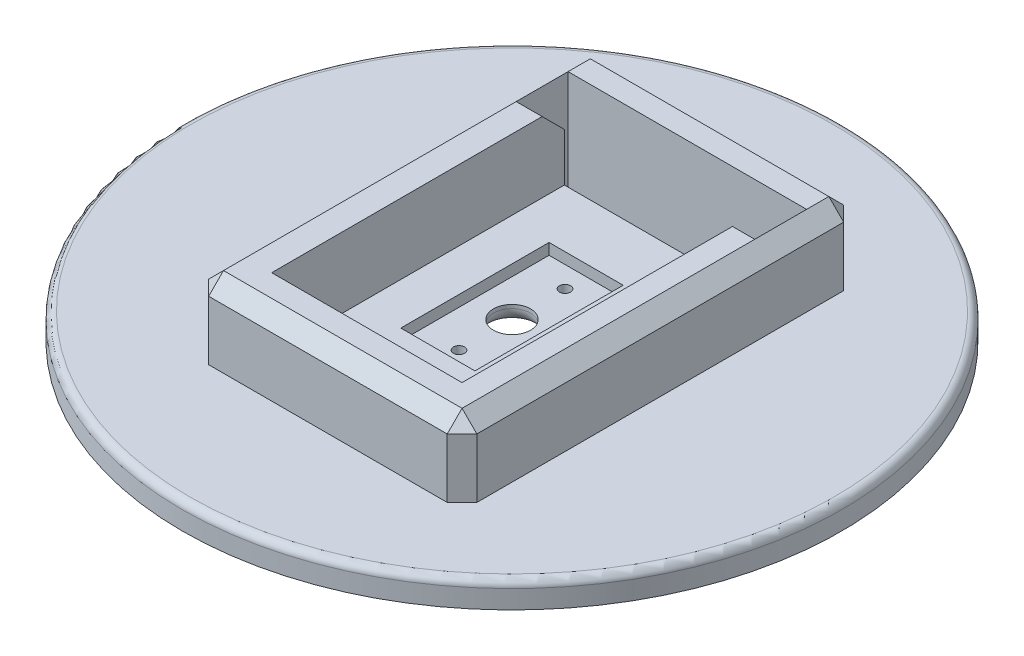
ISO-10303-21;
HEADER;
FILE_DESCRIPTION(('STEP AP214'),'2;1');
FILE_NAME('part.step','',(''),(''),'','','');
FILE_SCHEMA(('AUTOMOTIVE_DESIGN { 1 0 10303 214 1 1 1 1 }'));
ENDSEC;
DATA;
#1=APPLICATION_CONTEXT('core data for automotive mechanical design processes');
#2=APPLICATION_PROTOCOL_DEFINITION('international standard','automotive_design',2000,#1);
#3=PRODUCT_CONTEXT('',#1,'mechanical');
#4=PRODUCT('Part','Part','',(#3));
#5=PRODUCT_RELATED_PRODUCT_CATEGORY('part','',(#4));
#6=PRODUCT_DEFINITION_FORMATION('','',#4);
#7=PRODUCT_DEFINITION_CONTEXT('part definition',#1,'design');
#8=PRODUCT_DEFINITION('design','',#6,#7);
#9=PRODUCT_DEFINITION_SHAPE('','',#8);
#10=(LENGTH_UNIT() NAMED_UNIT(*) SI_UNIT(.MILLI.,.METRE.));
#11=(NAMED_UNIT(*) PLANE_ANGLE_UNIT() SI_UNIT($,.RADIAN.));
#12=(NAMED_UNIT(*) SI_UNIT($,.STERADIAN.) SOLID_ANGLE_UNIT());
#13=UNCERTAINTY_MEASURE_WITH_UNIT(LENGTH_MEASURE(1.E-05),#10,'distance_accuracy_value','');
#14=(GEOMETRIC_REPRESENTATION_CONTEXT(3) GLOBAL_UNCERTAINTY_ASSIGNED_CONTEXT((#13)) GLOBAL_UNIT_ASSIGNED_CONTEXT((#10,
#11,#12)) REPRESENTATION_CONTEXT('',''));
#15=CARTESIAN_POINT('',(0.,0.,0.));
#16=DIRECTION('',(0.,0.,1.));
#17=DIRECTION('',(1.,0.,0.));
#18=AXIS2_PLACEMENT_3D('',#15,#16,#17);
#19=CARTESIAN_POINT('',(0.,2.5,0.));
#20=DIRECTION('',(0.,1.,0.));
#21=DIRECTION('',(0.,0.,1.));
#22=AXIS2_PLACEMENT_3D('',#19,#20,#21);
#23=PLANE('',#22);
#24=CARTESIAN_POINT('',(0.,2.5,-7.15));
#25=DIRECTION('',(0.,1.,0.));
#26=DIRECTION('',(0.,0.,1.));
#27=AXIS2_PLACEMENT_3D('',#24,#25,#26);
#28=CIRCLE('',#27,0.75);
#29=CARTESIAN_POINT('',(0.,2.5,-6.4));
#30=VERTEX_POINT('',#29);
#31=EDGE_CURVE('E272',#30,#30,#28,.T.);
#32=ORIENTED_EDGE('',*,*,#31,.F.);
#33=EDGE_LOOP('',(#32));
#34=FACE_BOUND('',#33,.T.);
#35=CARTESIAN_POINT('',(0.,2.5,7.15));
#36=DIRECTION('',(0.,1.,0.));
#37=DIRECTION('',(0.,0.,1.));
#38=AXIS2_PLACEMENT_3D('',#35,#36,#37);
#39=CIRCLE('',#38,0.749999999999999);
#40=CARTESIAN_POINT('',(0.,2.5,7.9));
#41=VERTEX_POINT('',#40);
#42=EDGE_CURVE('E267',#41,#41,#39,.T.);
#43=ORIENTED_EDGE('',*,*,#42,.F.);
#44=EDGE_LOOP('',(#43));
#45=FACE_BOUND('',#44,.T.);
#46=CARTESIAN_POINT('',(0.,2.5,0.));
#47=DIRECTION('',(0.,1.,0.));
#48=DIRECTION('',(0.,0.,1.));
#49=AXIS2_PLACEMENT_3D('',#46,#47,#48);
#50=CIRCLE('',#49,2.5);
#51=CARTESIAN_POINT('',(0.,2.5,2.5));
#52=VERTEX_POINT('',#51);
#53=EDGE_CURVE('E276',#52,#52,#50,.T.);
#54=ORIENTED_EDGE('',*,*,#53,.F.);
#55=EDGE_LOOP('',(#54));
#56=FACE_BOUND('',#55,.T.);
#57=DIRECTION('',(0.,0.,1.));
#58=VECTOR('',#57,1.);
#59=CARTESIAN_POINT('',(5.,2.5,0.));
#60=LINE('',#59,#58);
#61=CARTESIAN_POINT('',(5.,2.5,-10.));
#62=VERTEX_POINT('',#61);
#63=CARTESIAN_POINT('',(5.,2.5,10.));
#64=VERTEX_POINT('',#63);
#65=EDGE_CURVE('E539',#62,#64,#60,.T.);
#66=ORIENTED_EDGE('',*,*,#65,.F.);
#67=DIRECTION('',(1.,0.,0.));
#68=VECTOR('',#67,1.);
#69=CARTESIAN_POINT('',(0.,2.5,-10.));
#70=LINE('',#69,#68);
#71=CARTESIAN_POINT('',(-5.,2.5,-10.));
#72=VERTEX_POINT('',#71);
#73=EDGE_CURVE('E535',#72,#62,#70,.T.);
#74=ORIENTED_EDGE('',*,*,#73,.F.);
#75=DIRECTION('',(0.,0.,-1.));
#76=VECTOR('',#75,1.);
#77=CARTESIAN_POINT('',(-5.,2.5,0.));
#78=LINE('',#77,#76);
#79=CARTESIAN_POINT('',(-5.,2.5,10.));
#80=VERTEX_POINT('',#79);
#81=EDGE_CURVE('E232',#80,#72,#78,.T.);
#82=ORIENTED_EDGE('',*,*,#81,.F.);
#83=DIRECTION('',(-1.,0.,0.));
#84=VECTOR('',#83,1.);
#85=CARTESIAN_POINT('',(0.,2.5,10.));
#86=LINE('',#85,#84);
#87=EDGE_CURVE('E542',#64,#80,#86,.T.);
#88=ORIENTED_EDGE('',*,*,#87,.F.);
#89=EDGE_LOOP('',(#66,#74,#82,#88));
#90=FACE_BOUND('',#89,.T.);
#91=ADVANCED_FACE('F47',(#34,#45,#56,#90),#23,.T.);
#92=CARTESIAN_POINT('',(0.,13.5,0.));
#93=DIRECTION('',(0.,1.,0.));
#94=DIRECTION('',(0.,0.,1.));
#95=AXIS2_PLACEMENT_3D('',#92,#93,#94);
#96=PLANE('',#95);
#97=DIRECTION('',(1.,0.,0.));
#98=VECTOR('',#97,1.);
#99=CARTESIAN_POINT('',(0.,13.5,-21.7375));
#100=LINE('',#99,#98);
#101=CARTESIAN_POINT('',(-14.175,13.5,-21.7375));
#102=VERTEX_POINT('',#101);
#103=CARTESIAN_POINT('',(18.,13.5,-21.7375));
#104=VERTEX_POINT('',#103);
#105=EDGE_CURVE('E298',#102,#104,#100,.T.);
#106=ORIENTED_EDGE('',*,*,#105,.T.);
#107=DIRECTION('',(0.,0.,-1.));
#108=VECTOR('',#107,1.);
#109=CARTESIAN_POINT('',(18.,13.5,0.));
#110=LINE('',#109,#108);
#111=CARTESIAN_POINT('',(18.,13.5,-24.7375));
#112=VERTEX_POINT('',#111);
#113=EDGE_CURVE('E380',#104,#112,#110,.T.);
#114=ORIENTED_EDGE('',*,*,#113,.T.);
#115=DIRECTION('',(-1.,0.,0.));
#116=VECTOR('',#115,1.);
#117=CARTESIAN_POINT('',(0.,13.5,-24.7375));
#118=LINE('',#117,#116);
#119=CARTESIAN_POINT('',(-14.175,13.5,-24.7375));
#120=VERTEX_POINT('',#119);
#121=EDGE_CURVE('E393',#112,#120,#118,.T.);
#122=ORIENTED_EDGE('',*,*,#121,.T.);
#123=DIRECTION('',(0.,0.,1.));
#124=VECTOR('',#123,1.);
#125=CARTESIAN_POINT('',(-14.175,13.5,0.));
#126=LINE('',#125,#124);
#127=EDGE_CURVE('E389',#120,#102,#126,.T.);
#128=ORIENTED_EDGE('',*,*,#127,.T.);
#129=EDGE_LOOP('',(#106,#114,#122,#128));
#130=FACE_BOUND('',#129,.T.);
#131=ADVANCED_FACE('F565',(#130),#96,.T.);
#132=CARTESIAN_POINT('',(0.,3.5,0.));
#133=DIRECTION('',(0.,-1.,0.));
#134=DIRECTION('',(0.,0.,-1.));
#135=AXIS2_PLACEMENT_3D('',#132,#133,#134);
#136=CYLINDRICAL_SURFACE('',#135,44.45);
#137=CARTESIAN_POINT('',(0.,2.5,0.));
#138=DIRECTION('',(0.,1.,0.));
#139=DIRECTION('',(0.,0.,1.));
#140=AXIS2_PLACEMENT_3D('',#137,#138,#139);
#141=CIRCLE('',#140,44.45);
#142=CARTESIAN_POINT('',(0.,2.5,44.45));
#143=VERTEX_POINT('',#142);
#144=EDGE_CURVE('E339',#143,#143,#141,.F.);
#145=ORIENTED_EDGE('',*,*,#144,.T.);
#146=EDGE_LOOP('',(#145));
#147=FACE_BOUND('',#146,.T.);
#148=CARTESIAN_POINT('',(0.,0.,0.));
#149=DIRECTION('',(0.,1.,0.));
#150=DIRECTION('',(0.,0.,1.));
#151=AXIS2_PLACEMENT_3D('',#148,#149,#150);
#152=CIRCLE('',#151,44.45);
#153=CARTESIAN_POINT('',(0.,0.,44.45));
#154=VERTEX_POINT('',#153);
#155=EDGE_CURVE('E321',#154,#154,#152,.T.);
#156=ORIENTED_EDGE('',*,*,#155,.T.);
#157=EDGE_LOOP('',(#156));
#158=FACE_BOUND('',#157,.T.);
#159=ADVANCED_FACE('F650',(#147,#158),#136,.T.);
#160=CARTESIAN_POINT('',(0.,3.5,0.));
#161=DIRECTION('',(0.,1.,0.));
#162=DIRECTION('',(0.,0.,1.));
#163=AXIS2_PLACEMENT_3D('',#160,#161,#162);
#164=PLANE('',#163);
#165=CARTESIAN_POINT('',(0.,3.5,0.));
#166=DIRECTION('',(0.,1.,0.));
#167=DIRECTION('',(0.,0.,1.));
#168=AXIS2_PLACEMENT_3D('',#165,#166,#167);
#169=CIRCLE('',#168,43.45);
#170=CARTESIAN_POINT('',(0.,3.5,43.45));
#171=VERTEX_POINT('',#170);
#172=EDGE_CURVE('E331',#171,#171,#169,.T.);
#173=ORIENTED_EDGE('',*,*,#172,.T.);
#174=EDGE_LOOP('',(#173));
#175=FACE_BOUND('',#174,.T.);
#176=DIRECTION('',(0.,0.,1.));
#177=VECTOR('',#176,1.);
#178=CARTESIAN_POINT('',(20.,3.5,0.));
#179=LINE('',#178,#177);
#180=CARTESIAN_POINT('',(20.,3.5,-24.7375));
#181=VERTEX_POINT('',#180);
#182=CARTESIAN_POINT('',(20.,3.5,24.7375));
#183=VERTEX_POINT('',#182);
#184=EDGE_CURVE('E305',#181,#183,#179,.T.);
#185=ORIENTED_EDGE('',*,*,#184,.T.);
#186=DIRECTION('',(0.707106781186548,0.,-0.707106781186548));
#187=VECTOR('',#186,1.);
#188=CARTESIAN_POINT('',(20.,3.5,24.7375));
#189=LINE('',#188,#187);
#190=CARTESIAN_POINT('',(18.,3.5,26.7375));
#191=VERTEX_POINT('',#190);
#192=EDGE_CURVE('E403',#183,#191,#189,.F.);
#193=ORIENTED_EDGE('',*,*,#192,.T.);
#194=DIRECTION('',(-1.,0.,0.));
#195=VECTOR('',#194,1.);
#196=CARTESIAN_POINT('',(0.,3.5,26.7375));
#197=LINE('',#196,#195);
#198=CARTESIAN_POINT('',(-14.175,3.5,26.7375));
#199=VERTEX_POINT('',#198);
#200=EDGE_CURVE('E284',#191,#199,#197,.T.);
#201=ORIENTED_EDGE('',*,*,#200,.T.);
#202=DIRECTION('',(0.707106781186548,0.,0.707106781186548));
#203=VECTOR('',#202,1.);
#204=CARTESIAN_POINT('',(-14.175,3.5,26.7375));
#205=LINE('',#204,#203);
#206=CARTESIAN_POINT('',(-16.175,3.5,24.7375));
#207=VERTEX_POINT('',#206);
#208=EDGE_CURVE('E400',#199,#207,#205,.F.);
#209=ORIENTED_EDGE('',*,*,#208,.T.);
#210=DIRECTION('',(0.,0.,-1.));
#211=VECTOR('',#210,1.);
#212=CARTESIAN_POINT('',(-16.175,3.5,0.));
#213=LINE('',#212,#211);
#214=CARTESIAN_POINT('',(-16.175,3.5,-24.7375));
#215=VERTEX_POINT('',#214);
#216=EDGE_CURVE('E290',#207,#215,#213,.T.);
#217=ORIENTED_EDGE('',*,*,#216,.T.);
#218=DIRECTION('',(-0.707106781186548,0.,0.707106781186548));
#219=VECTOR('',#218,1.);
#220=CARTESIAN_POINT('',(-16.175,3.5,-24.7375));
#221=LINE('',#220,#219);
#222=CARTESIAN_POINT('',(-14.175,3.5,-26.7375));
#223=VERTEX_POINT('',#222);
#224=EDGE_CURVE('E397',#215,#223,#221,.F.);
#225=ORIENTED_EDGE('',*,*,#224,.T.);
#226=DIRECTION('',(1.,0.,0.));
#227=VECTOR('',#226,1.);
#228=CARTESIAN_POINT('',(0.,3.5,-26.7375));
#229=LINE('',#228,#227);
#230=CARTESIAN_POINT('',(18.,3.5,-26.7375));
#231=VERTEX_POINT('',#230);
#232=EDGE_CURVE('E309',#223,#231,#229,.T.);
#233=ORIENTED_EDGE('',*,*,#232,.T.);
#234=DIRECTION('',(-0.707106781186548,0.,-0.707106781186548));
#235=VECTOR('',#234,1.);
#236=CARTESIAN_POINT('',(18.,3.5,-26.7375));
#237=LINE('',#236,#235);
#238=EDGE_CURVE('E406',#231,#181,#237,.F.);
#239=ORIENTED_EDGE('',*,*,#238,.T.);
#240=EDGE_LOOP('',(#185,#193,#201,#209,#217,#225,#233,#239));
#241=FACE_BOUND('',#240,.T.);
#242=ADVANCED_FACE('F600',(#175,#241),#164,.T.);
#243=CARTESIAN_POINT('',(0.,0.,0.));
#244=DIRECTION('',(0.,1.,0.));
#245=DIRECTION('',(0.,0.,1.));
#246=AXIS2_PLACEMENT_3D('',#243,#244,#245);
#247=PLANE('',#246);
#248=CARTESIAN_POINT('',(0.,0.,0.));
#249=DIRECTION('',(0.,1.,0.));
#250=DIRECTION('',(0.,0.,1.));
#251=AXIS2_PLACEMENT_3D('',#248,#249,#250);
#252=CIRCLE('',#251,4.5);
#253=CARTESIAN_POINT('',(0.,0.,4.5));
#254=VERTEX_POINT('',#253);
#255=EDGE_CURVE('E458',#254,#254,#252,.T.);
#256=ORIENTED_EDGE('',*,*,#255,.T.);
#257=EDGE_LOOP('',(#256));
#258=FACE_BOUND('',#257,.T.);
#259=CARTESIAN_POINT('',(0.,0.,7.15));
#260=DIRECTION('',(0.,1.,0.));
#261=DIRECTION('',(0.,0.,1.));
#262=AXIS2_PLACEMENT_3D('',#259,#260,#261);
#263=CIRCLE('',#262,0.749999999999999);
#264=CARTESIAN_POINT('',(0.,0.,7.9));
#265=VERTEX_POINT('',#264);
#266=EDGE_CURVE('E280',#265,#265,#263,.T.);
#267=ORIENTED_EDGE('',*,*,#266,.T.);
#268=EDGE_LOOP('',(#267));
#269=FACE_BOUND('',#268,.T.);
#270=CARTESIAN_POINT('',(0.,0.,-7.15));
#271=DIRECTION('',(0.,1.,0.));
#272=DIRECTION('',(0.,0.,1.));
#273=AXIS2_PLACEMENT_3D('',#270,#271,#272);
#274=CIRCLE('',#273,0.75);
#275=CARTESIAN_POINT('',(0.,0.,-6.4));
#276=VERTEX_POINT('',#275);
#277=EDGE_CURVE('E271',#276,#276,#274,.T.);
#278=ORIENTED_EDGE('',*,*,#277,.T.);
#279=EDGE_LOOP('',(#278));
#280=FACE_BOUND('',#279,.T.);
#281=DIRECTION('',(0.,0.,-1.));
#282=VECTOR('',#281,1.);
#283=CARTESIAN_POINT('',(18.,0.,-17.7375));
#284=LINE('',#283,#282);
#285=CARTESIAN_POINT('',(18.,0.,-17.7375));
#286=VERTEX_POINT('',#285);
#287=CARTESIAN_POINT('',(18.,0.,-21.7375));
#288=VERTEX_POINT('',#287);
#289=EDGE_CURVE('E241',#286,#288,#284,.T.);
#290=ORIENTED_EDGE('',*,*,#289,.T.);
#291=DIRECTION('',(-1.,0.,0.));
#292=VECTOR('',#291,1.);
#293=CARTESIAN_POINT('',(0.,0.,-21.7375));
#294=LINE('',#293,#292);
#295=CARTESIAN_POINT('',(-14.175,0.,-21.7375));
#296=VERTEX_POINT('',#295);
#297=EDGE_CURVE('E328',#288,#296,#294,.T.);
#298=ORIENTED_EDGE('',*,*,#297,.T.);
#299=DIRECTION('',(0.,0.,1.));
#300=VECTOR('',#299,1.);
#301=CARTESIAN_POINT('',(-14.175,0.,-17.7375));
#302=LINE('',#301,#300);
#303=CARTESIAN_POINT('',(-14.175,0.,-17.7375));
#304=VERTEX_POINT('',#303);
#305=EDGE_CURVE('E253',#296,#304,#302,.T.);
#306=ORIENTED_EDGE('',*,*,#305,.T.);
#307=DIRECTION('',(1.,0.,0.));
#308=VECTOR('',#307,1.);
#309=CARTESIAN_POINT('',(0.,0.,-17.7375));
#310=LINE('',#309,#308);
#311=EDGE_CURVE('E325',#304,#286,#310,.T.);
#312=ORIENTED_EDGE('',*,*,#311,.T.);
#313=EDGE_LOOP('',(#290,#298,#306,#312));
#314=FACE_BOUND('',#313,.T.);
#315=ORIENTED_EDGE('',*,*,#155,.F.);
#316=EDGE_LOOP('',(#315));
#317=FACE_BOUND('',#316,.T.);
#318=ADVANCED_FACE('F498',(#258,#269,#280,#314,#317),#247,.F.);
#319=CARTESIAN_POINT('',(0.,13.5,26.7375));
#320=DIRECTION('',(0.,0.,1.));
#321=DIRECTION('',(1.,0.,0.));
#322=AXIS2_PLACEMENT_3D('',#319,#320,#321);
#323=PLANE('',#322);
#324=DIRECTION('',(-1.,0.,0.));
#325=VECTOR('',#324,1.);
#326=CARTESIAN_POINT('',(0.,11.5,26.7375));
#327=LINE('',#326,#325);
#328=CARTESIAN_POINT('',(18.,11.5,26.7375));
#329=VERTEX_POINT('',#328);
#330=CARTESIAN_POINT('',(-14.175,11.5,26.7375));
#331=VERTEX_POINT('',#330);
#332=EDGE_CURVE('E362',#329,#331,#327,.T.);
#333=ORIENTED_EDGE('',*,*,#332,.T.);
#334=DIRECTION('',(0.,-1.,0.));
#335=VECTOR('',#334,1.);
#336=CARTESIAN_POINT('',(-14.175,13.5,26.7375));
#337=LINE('',#336,#335);
#338=EDGE_CURVE('E368',#331,#199,#337,.T.);
#339=ORIENTED_EDGE('',*,*,#338,.T.);
#340=ORIENTED_EDGE('',*,*,#200,.F.);
#341=DIRECTION('',(0.,1.,0.));
#342=VECTOR('',#341,1.);
#343=CARTESIAN_POINT('',(18.,13.5,26.7375));
#344=LINE('',#343,#342);
#345=EDGE_CURVE('E365',#191,#329,#344,.T.);
#346=ORIENTED_EDGE('',*,*,#345,.T.);
#347=EDGE_LOOP('',(#333,#339,#340,#346));
#348=FACE_BOUND('',#347,.T.);
#349=ADVANCED_FACE('F597',(#348),#323,.T.);
#350=CARTESIAN_POINT('',(20.,13.5,0.));
#351=DIRECTION('',(1.,0.,0.));
#352=DIRECTION('',(0.,0.,-1.));
#353=AXIS2_PLACEMENT_3D('',#350,#351,#352);
#354=PLANE('',#353);
#355=DIRECTION('',(0.,0.,1.));
#356=VECTOR('',#355,1.);
#357=CARTESIAN_POINT('',(20.,11.5,0.));
#358=LINE('',#357,#356);
#359=CARTESIAN_POINT('',(20.,11.5,-24.7375));
#360=VERTEX_POINT('',#359);
#361=CARTESIAN_POINT('',(20.,11.5,24.7375));
#362=VERTEX_POINT('',#361);
#363=EDGE_CURVE('E371',#360,#362,#358,.T.);
#364=ORIENTED_EDGE('',*,*,#363,.T.);
#365=DIRECTION('',(0.,-1.,0.));
#366=VECTOR('',#365,1.);
#367=CARTESIAN_POINT('',(20.,13.5,24.7375));
#368=LINE('',#367,#366);
#369=EDGE_CURVE('E377',#362,#183,#368,.T.);
#370=ORIENTED_EDGE('',*,*,#369,.T.);
#371=ORIENTED_EDGE('',*,*,#184,.F.);
#372=DIRECTION('',(0.,1.,0.));
#373=VECTOR('',#372,1.);
#374=CARTESIAN_POINT('',(20.,13.5,-24.7375));
#375=LINE('',#374,#373);
#376=EDGE_CURVE('E374',#181,#360,#375,.T.);
#377=ORIENTED_EDGE('',*,*,#376,.T.);
#378=EDGE_LOOP('',(#364,#370,#371,#377));
#379=FACE_BOUND('',#378,.T.);
#380=ADVANCED_FACE('F634',(#379),#354,.T.);
#381=CARTESIAN_POINT('',(0.,13.5,-26.7375));
#382=DIRECTION('',(0.,0.,-1.));
#383=DIRECTION('',(-1.,0.,0.));
#384=AXIS2_PLACEMENT_3D('',#381,#382,#383);
#385=PLANE('',#384);
#386=ORIENTED_EDGE('',*,*,#232,.F.);
#387=DIRECTION('',(0.,1.,0.));
#388=VECTOR('',#387,1.);
#389=CARTESIAN_POINT('',(-14.175,13.5,-26.7375));
#390=LINE('',#389,#388);
#391=CARTESIAN_POINT('',(-14.175,11.5,-26.7375));
#392=VERTEX_POINT('',#391);
#393=EDGE_CURVE('E359',#223,#392,#390,.T.);
#394=ORIENTED_EDGE('',*,*,#393,.T.);
#395=DIRECTION('',(1.,0.,0.));
#396=VECTOR('',#395,1.);
#397=CARTESIAN_POINT('',(0.,11.5,-26.7375));
#398=LINE('',#397,#396);
#399=CARTESIAN_POINT('',(18.,11.5,-26.7375));
#400=VERTEX_POINT('',#399);
#401=EDGE_CURVE('E353',#392,#400,#398,.T.);
#402=ORIENTED_EDGE('',*,*,#401,.T.);
#403=DIRECTION('',(0.,-1.,0.));
#404=VECTOR('',#403,1.);
#405=CARTESIAN_POINT('',(18.,13.5,-26.7375));
#406=LINE('',#405,#404);
#407=EDGE_CURVE('E356',#400,#231,#406,.T.);
#408=ORIENTED_EDGE('',*,*,#407,.T.);
#409=EDGE_LOOP('',(#386,#394,#402,#408));
#410=FACE_BOUND('',#409,.T.);
#411=ADVANCED_FACE('F632',(#410),#385,.T.);
#412=CARTESIAN_POINT('',(-16.175,13.5,0.));
#413=DIRECTION('',(-1.,0.,0.));
#414=DIRECTION('',(0.,0.,1.));
#415=AXIS2_PLACEMENT_3D('',#412,#413,#414);
#416=PLANE('',#415);
#417=DIRECTION('',(0.,0.,-1.));
#418=VECTOR('',#417,1.);
#419=CARTESIAN_POINT('',(-16.175,11.5,0.));
#420=LINE('',#419,#418);
#421=CARTESIAN_POINT('',(-16.175,11.5,24.7375));
#422=VERTEX_POINT('',#421);
#423=CARTESIAN_POINT('',(-16.175,11.5,-24.7375));
#424=VERTEX_POINT('',#423);
#425=EDGE_CURVE('E343',#422,#424,#420,.T.);
#426=ORIENTED_EDGE('',*,*,#425,.T.);
#427=DIRECTION('',(0.,-1.,0.));
#428=VECTOR('',#427,1.);
#429=CARTESIAN_POINT('',(-16.175,13.5,-24.7375));
#430=LINE('',#429,#428);
#431=EDGE_CURVE('E349',#424,#215,#430,.T.);
#432=ORIENTED_EDGE('',*,*,#431,.T.);
#433=ORIENTED_EDGE('',*,*,#216,.F.);
#434=DIRECTION('',(0.,1.,0.));
#435=VECTOR('',#434,1.);
#436=CARTESIAN_POINT('',(-16.175,13.5,24.7375));
#437=LINE('',#436,#435);
#438=EDGE_CURVE('E346',#207,#422,#437,.T.);
#439=ORIENTED_EDGE('',*,*,#438,.T.);
#440=EDGE_LOOP('',(#426,#432,#433,#439));
#441=FACE_BOUND('',#440,.T.);
#442=ADVANCED_FACE('F587',(#441),#416,.T.);
#443=CARTESIAN_POINT('',(18.,13.5,24.7375));
#444=VERTEX_POINT('',#443);
#445=CARTESIAN_POINT('',(18.,13.5,-14.7375));
#446=VERTEX_POINT('',#445);
#447=EDGE_CURVE('E381',#444,#446,#110,.T.);
#448=ORIENTED_EDGE('',*,*,#447,.T.);
#449=DIRECTION('',(-1.,0.,0.));
#450=VECTOR('',#449,1.);
#451=CARTESIAN_POINT('',(15.,13.5,-14.7375));
#452=LINE('',#451,#450);
#453=CARTESIAN_POINT('',(15.,13.5,-14.7375));
#454=VERTEX_POINT('',#453);
#455=EDGE_CURVE('E471',#446,#454,#452,.T.);
#456=ORIENTED_EDGE('',*,*,#455,.T.);
#457=DIRECTION('',(0.,0.,1.));
#458=VECTOR('',#457,1.);
#459=CARTESIAN_POINT('',(15.,13.5,0.));
#460=LINE('',#459,#458);
#461=CARTESIAN_POINT('',(15.,13.5,21.7375));
#462=VERTEX_POINT('',#461);
#463=EDGE_CURVE('E285',#454,#462,#460,.T.);
#464=ORIENTED_EDGE('',*,*,#463,.T.);
#465=DIRECTION('',(-1.,0.,0.));
#466=VECTOR('',#465,1.);
#467=CARTESIAN_POINT('',(0.,13.5,21.7375));
#468=LINE('',#467,#466);
#469=CARTESIAN_POINT('',(-10.675,13.5,21.7375));
#470=VERTEX_POINT('',#469);
#471=EDGE_CURVE('E289',#462,#470,#468,.T.);
#472=ORIENTED_EDGE('',*,*,#471,.T.);
#473=DIRECTION('',(0.,0.,-1.));
#474=VECTOR('',#473,1.);
#475=CARTESIAN_POINT('',(-10.675,13.5,0.));
#476=LINE('',#475,#474);
#477=CARTESIAN_POINT('',(-10.675,13.5,-14.7375));
#478=VERTEX_POINT('',#477);
#479=EDGE_CURVE('E294',#470,#478,#476,.T.);
#480=ORIENTED_EDGE('',*,*,#479,.T.);
#481=DIRECTION('',(-1.,0.,0.));
#482=VECTOR('',#481,1.);
#483=CARTESIAN_POINT('',(-14.175,13.5,-14.7375));
#484=LINE('',#483,#482);
#485=CARTESIAN_POINT('',(-14.175,13.5,-14.7375));
#486=VERTEX_POINT('',#485);
#487=EDGE_CURVE('E468',#478,#486,#484,.T.);
#488=ORIENTED_EDGE('',*,*,#487,.T.);
#489=CARTESIAN_POINT('',(-14.175,13.5,24.7375));
#490=VERTEX_POINT('',#489);
#491=EDGE_CURVE('E388',#486,#490,#126,.T.);
#492=ORIENTED_EDGE('',*,*,#491,.T.);
#493=DIRECTION('',(1.,0.,0.));
#494=VECTOR('',#493,1.);
#495=CARTESIAN_POINT('',(0.,13.5,24.7375));
#496=LINE('',#495,#494);
#497=EDGE_CURVE('E385',#490,#444,#496,.T.);
#498=ORIENTED_EDGE('',*,*,#497,.T.);
#499=EDGE_LOOP('',(#448,#456,#464,#472,#480,#488,#492,#498));
#500=FACE_BOUND('',#499,.T.);
#501=ADVANCED_FACE('F491',(#500),#96,.T.);
#502=CARTESIAN_POINT('',(15.,2.5,0.));
#503=DIRECTION('',(1.,0.,0.));
#504=DIRECTION('',(0.,0.,-1.));
#505=AXIS2_PLACEMENT_3D('',#502,#503,#504);
#506=PLANE('',#505);
#507=DIRECTION('',(0.,1.,0.));
#508=VECTOR('',#507,1.);
#509=CARTESIAN_POINT('',(15.,0.,-17.7375));
#510=LINE('',#509,#508);
#511=CARTESIAN_POINT('',(15.,4.,-17.7375));
#512=VERTEX_POINT('',#511);
#513=CARTESIAN_POINT('',(15.,10.5,-17.7375));
#514=VERTEX_POINT('',#513);
#515=EDGE_CURVE('E214',#512,#514,#510,.T.);
#516=ORIENTED_EDGE('',*,*,#515,.F.);
#517=DIRECTION('',(0.,0.,-1.));
#518=VECTOR('',#517,1.);
#519=CARTESIAN_POINT('',(15.,4.,0.));
#520=LINE('',#519,#518);
#521=CARTESIAN_POINT('',(15.,4.,21.7375));
#522=VERTEX_POINT('',#521);
#523=EDGE_CURVE('E222',#522,#512,#520,.T.);
#524=ORIENTED_EDGE('',*,*,#523,.F.);
#525=DIRECTION('',(0.,1.,0.));
#526=VECTOR('',#525,1.);
#527=CARTESIAN_POINT('',(15.,2.5,21.7375));
#528=LINE('',#527,#526);
#529=EDGE_CURVE('E318',#522,#462,#528,.T.);
#530=ORIENTED_EDGE('',*,*,#529,.T.);
#531=ORIENTED_EDGE('',*,*,#463,.F.);
#532=DIRECTION('',(0.,-0.707106781186546,-0.707106781186549));
#533=VECTOR('',#532,1.);
#534=CARTESIAN_POINT('',(15.,10.5,-17.7375));
#535=LINE('',#534,#533);
#536=EDGE_CURVE('E237',#454,#514,#535,.T.);
#537=ORIENTED_EDGE('',*,*,#536,.T.);
#538=EDGE_LOOP('',(#516,#524,#530,#531,#537));
#539=FACE_BOUND('',#538,.T.);
#540=ADVANCED_FACE('F234',(#539),#506,.F.);
#541=CARTESIAN_POINT('',(15.,2.5,-21.7375));
#542=DIRECTION('',(0.,0.,-1.));
#543=DIRECTION('',(-1.,0.,0.));
#544=AXIS2_PLACEMENT_3D('',#541,#542,#543);
#545=PLANE('',#544);
#546=ORIENTED_EDGE('',*,*,#297,.F.);
#547=DIRECTION('',(0.,1.,0.));
#548=VECTOR('',#547,1.);
#549=CARTESIAN_POINT('',(18.,0.,-21.7375));
#550=LINE('',#549,#548);
#551=EDGE_CURVE('E246',#288,#104,#550,.T.);
#552=ORIENTED_EDGE('',*,*,#551,.T.);
#553=ORIENTED_EDGE('',*,*,#105,.F.);
#554=DIRECTION('',(0.,1.,0.));
#555=VECTOR('',#554,1.);
#556=CARTESIAN_POINT('',(-14.175,0.,-21.7375));
#557=LINE('',#556,#555);
#558=EDGE_CURVE('E257',#296,#102,#557,.T.);
#559=ORIENTED_EDGE('',*,*,#558,.F.);
#560=EDGE_LOOP('',(#546,#552,#553,#559));
#561=FACE_BOUND('',#560,.T.);
#562=ADVANCED_FACE('F563',(#561),#545,.F.);
#563=CARTESIAN_POINT('',(-10.675,2.5,-21.7375));
#564=DIRECTION('',(-1.,0.,0.));
#565=DIRECTION('',(0.,0.,1.));
#566=AXIS2_PLACEMENT_3D('',#563,#564,#565);
#567=PLANE('',#566);
#568=DIRECTION('',(0.,1.,0.));
#569=VECTOR('',#568,1.);
#570=CARTESIAN_POINT('',(-10.675,2.5,21.7375));
#571=LINE('',#570,#569);
#572=CARTESIAN_POINT('',(-10.675,4.,21.7375));
#573=VERTEX_POINT('',#572);
#574=EDGE_CURVE('E301',#573,#470,#571,.T.);
#575=ORIENTED_EDGE('',*,*,#574,.F.);
#576=DIRECTION('',(0.,0.,1.));
#577=VECTOR('',#576,1.);
#578=CARTESIAN_POINT('',(-10.675,4.,0.));
#579=LINE('',#578,#577);
#580=CARTESIAN_POINT('',(-10.675,4.,-17.7375));
#581=VERTEX_POINT('',#580);
#582=EDGE_CURVE('E221',#581,#573,#579,.T.);
#583=ORIENTED_EDGE('',*,*,#582,.F.);
#584=DIRECTION('',(0.,1.,0.));
#585=VECTOR('',#584,1.);
#586=CARTESIAN_POINT('',(-10.675,0.,-17.7375));
#587=LINE('',#586,#585);
#588=CARTESIAN_POINT('',(-10.675,10.5,-17.7375));
#589=VERTEX_POINT('',#588);
#590=EDGE_CURVE('E217',#581,#589,#587,.T.);
#591=ORIENTED_EDGE('',*,*,#590,.T.);
#592=DIRECTION('',(0.,0.707106781186546,0.707106781186549));
#593=VECTOR('',#592,1.);
#594=CARTESIAN_POINT('',(-10.675,10.5,-17.7375));
#595=LINE('',#594,#593);
#596=EDGE_CURVE('E476',#589,#478,#595,.T.);
#597=ORIENTED_EDGE('',*,*,#596,.T.);
#598=ORIENTED_EDGE('',*,*,#479,.F.);
#599=EDGE_LOOP('',(#575,#583,#591,#597,#598));
#600=FACE_BOUND('',#599,.T.);
#601=ADVANCED_FACE('F511',(#600),#567,.F.);
#602=CARTESIAN_POINT('',(-10.675,2.5,21.7375));
#603=DIRECTION('',(0.,0.,1.));
#604=DIRECTION('',(1.,0.,0.));
#605=AXIS2_PLACEMENT_3D('',#602,#603,#604);
#606=PLANE('',#605);
#607=ORIENTED_EDGE('',*,*,#529,.F.);
#608=DIRECTION('',(1.,0.,0.));
#609=VECTOR('',#608,1.);
#610=CARTESIAN_POINT('',(0.,4.,21.7375));
#611=LINE('',#610,#609);
#612=EDGE_CURVE('E228',#573,#522,#611,.T.);
#613=ORIENTED_EDGE('',*,*,#612,.F.);
#614=ORIENTED_EDGE('',*,*,#574,.T.);
#615=ORIENTED_EDGE('',*,*,#471,.F.);
#616=EDGE_LOOP('',(#607,#613,#614,#615));
#617=FACE_BOUND('',#616,.T.);
#618=ADVANCED_FACE('F515',(#617),#606,.F.);
#619=CARTESIAN_POINT('',(15.,-10.5,-17.7375));
#620=DIRECTION('',(0.,0.,1.));
#621=DIRECTION('',(1.,0.,0.));
#622=AXIS2_PLACEMENT_3D('',#619,#620,#621);
#623=PLANE('',#622);
#624=DIRECTION('',(-1.,0.,0.));
#625=VECTOR('',#624,1.);
#626=CARTESIAN_POINT('',(0.,4.,-17.7375));
#627=LINE('',#626,#625);
#628=EDGE_CURVE('E209',#512,#581,#627,.T.);
#629=ORIENTED_EDGE('',*,*,#628,.F.);
#630=ORIENTED_EDGE('',*,*,#515,.T.);
#631=DIRECTION('',(1.,0.,0.));
#632=VECTOR('',#631,1.);
#633=CARTESIAN_POINT('',(18.,10.5,-17.7375));
#634=LINE('',#633,#632);
#635=CARTESIAN_POINT('',(18.,10.5,-17.7375));
#636=VERTEX_POINT('',#635);
#637=EDGE_CURVE('E465',#514,#636,#634,.T.);
#638=ORIENTED_EDGE('',*,*,#637,.T.);
#639=DIRECTION('',(0.,1.,0.));
#640=VECTOR('',#639,1.);
#641=CARTESIAN_POINT('',(18.,0.,-17.7375));
#642=LINE('',#641,#640);
#643=EDGE_CURVE('E240',#286,#636,#642,.T.);
#644=ORIENTED_EDGE('',*,*,#643,.F.);
#645=ORIENTED_EDGE('',*,*,#311,.F.);
#646=DIRECTION('',(0.,1.,0.));
#647=VECTOR('',#646,1.);
#648=CARTESIAN_POINT('',(-14.175,0.,-17.7375));
#649=LINE('',#648,#647);
#650=CARTESIAN_POINT('',(-14.175,10.5,-17.7375));
#651=VERTEX_POINT('',#650);
#652=EDGE_CURVE('E261',#304,#651,#649,.T.);
#653=ORIENTED_EDGE('',*,*,#652,.T.);
#654=DIRECTION('',(1.,0.,0.));
#655=VECTOR('',#654,1.);
#656=CARTESIAN_POINT('',(-10.675,10.5,-17.7375));
#657=LINE('',#656,#655);
#658=EDGE_CURVE('E462',#651,#589,#657,.T.);
#659=ORIENTED_EDGE('',*,*,#658,.T.);
#660=ORIENTED_EDGE('',*,*,#590,.F.);
#661=EDGE_LOOP('',(#629,#630,#638,#644,#645,#653,#659,#660));
#662=FACE_BOUND('',#661,.T.);
#663=ADVANCED_FACE('F211',(#662),#623,.F.);
#664=CARTESIAN_POINT('',(0.,-10.5,-7.15));
#665=DIRECTION('',(0.,1.,0.));
#666=DIRECTION('',(0.,0.,1.));
#667=AXIS2_PLACEMENT_3D('',#664,#665,#666);
#668=CYLINDRICAL_SURFACE('',#667,0.75);
#669=ORIENTED_EDGE('',*,*,#31,.T.);
#670=EDGE_LOOP('',(#669));
#671=FACE_BOUND('',#670,.T.);
#672=ORIENTED_EDGE('',*,*,#277,.F.);
#673=EDGE_LOOP('',(#672));
#674=FACE_BOUND('',#673,.T.);
#675=ADVANCED_FACE('F763',(#671,#674),#668,.F.);
#676=CARTESIAN_POINT('',(0.,-10.5,7.15));
#677=DIRECTION('',(0.,1.,0.));
#678=DIRECTION('',(0.,0.,1.));
#679=AXIS2_PLACEMENT_3D('',#676,#677,#678);
#680=CYLINDRICAL_SURFACE('',#679,0.749999999999999);
#681=ORIENTED_EDGE('',*,*,#42,.T.);
#682=EDGE_LOOP('',(#681));
#683=FACE_BOUND('',#682,.T.);
#684=ORIENTED_EDGE('',*,*,#266,.F.);
#685=EDGE_LOOP('',(#684));
#686=FACE_BOUND('',#685,.T.);
#687=ADVANCED_FACE('F759',(#683,#686),#680,.F.);
#688=CARTESIAN_POINT('',(0.,13.,0.));
#689=DIRECTION('',(0.,-1.,0.));
#690=DIRECTION('',(0.,0.,-1.));
#691=AXIS2_PLACEMENT_3D('',#688,#689,#690);
#692=CYLINDRICAL_SURFACE('',#691,2.5);
#693=CARTESIAN_POINT('',(0.,2.,0.));
#694=DIRECTION('',(0.,1.,0.));
#695=DIRECTION('',(0.,0.,1.));
#696=AXIS2_PLACEMENT_3D('',#693,#694,#695);
#697=CIRCLE('',#696,2.5);
#698=CARTESIAN_POINT('',(0.,2.,2.5));
#699=VERTEX_POINT('',#698);
#700=EDGE_CURVE('E409',#699,#699,#697,.F.);
#701=ORIENTED_EDGE('',*,*,#700,.T.);
#702=EDGE_LOOP('',(#701));
#703=FACE_BOUND('',#702,.T.);
#704=ORIENTED_EDGE('',*,*,#53,.T.);
#705=EDGE_LOOP('',(#704));
#706=FACE_BOUND('',#705,.T.);
#707=ADVANCED_FACE('F675',(#703,#706),#692,.F.);
#708=CARTESIAN_POINT('',(0.,2.5,0.));
#709=DIRECTION('',(0.,1.,0.));
#710=DIRECTION('',(0.,0.,1.));
#711=AXIS2_PLACEMENT_3D('',#708,#709,#710);
#712=TOROIDAL_SURFACE('',#711,43.45,1.);
#713=ORIENTED_EDGE('',*,*,#144,.F.);
#714=EDGE_LOOP('',(#713));
#715=FACE_BOUND('',#714,.T.);
#716=ORIENTED_EDGE('',*,*,#172,.F.);
#717=EDGE_LOOP('',(#716));
#718=FACE_BOUND('',#717,.T.);
#719=ADVANCED_FACE('F672',(#715,#718),#712,.T.);
#720=CARTESIAN_POINT('',(20.,13.5,24.7375));
#721=DIRECTION('',(-0.707106781186547,0.,-0.707106781186547));
#722=DIRECTION('',(0.,-1.,0.));
#723=AXIS2_PLACEMENT_3D('',#720,#721,#722);
#724=PLANE('',#723);
#725=DIRECTION('',(-0.707106781186547,0.,0.707106781186547));
#726=VECTOR('',#725,1.);
#727=CARTESIAN_POINT('',(18.,11.5,26.7375));
#728=LINE('',#727,#726);
#729=EDGE_CURVE('E335',#329,#362,#728,.F.);
#730=ORIENTED_EDGE('',*,*,#729,.F.);
#731=ORIENTED_EDGE('',*,*,#345,.F.);
#732=ORIENTED_EDGE('',*,*,#192,.F.);
#733=ORIENTED_EDGE('',*,*,#369,.F.);
#734=EDGE_LOOP('',(#730,#731,#732,#733));
#735=FACE_BOUND('',#734,.T.);
#736=ADVANCED_FACE('F606',(#735),#724,.F.);
#737=CARTESIAN_POINT('',(18.,11.5,26.7375));
#738=DIRECTION('',(0.577350269189626,0.577350269189626,0.577350269189626));
#739=DIRECTION('',(0.707106781186547,0.,-0.707106781186547));
#740=AXIS2_PLACEMENT_3D('',#737,#738,#739);
#741=PLANE('',#740);
#742=DIRECTION('',(0.,0.707106781186547,-0.707106781186547));
#743=VECTOR('',#742,1.);
#744=CARTESIAN_POINT('',(18.,11.5,26.7375));
#745=LINE('',#744,#743);
#746=EDGE_CURVE('E444',#329,#444,#745,.T.);
#747=ORIENTED_EDGE('',*,*,#746,.F.);
#748=ORIENTED_EDGE('',*,*,#729,.T.);
#749=DIRECTION('',(0.707106781186547,-0.707106781186547,0.));
#750=VECTOR('',#749,1.);
#751=CARTESIAN_POINT('',(19.,12.5,24.7375));
#752=LINE('',#751,#750);
#753=EDGE_CURVE('E448',#444,#362,#752,.T.);
#754=ORIENTED_EDGE('',*,*,#753,.F.);
#755=EDGE_LOOP('',(#747,#748,#754));
#756=FACE_BOUND('',#755,.T.);
#757=ADVANCED_FACE('F608',(#756),#741,.T.);
#758=CARTESIAN_POINT('',(18.,13.5,-26.7375));
#759=DIRECTION('',(-0.707106781186547,0.,0.707106781186547));
#760=DIRECTION('',(0.,-1.,0.));
#761=AXIS2_PLACEMENT_3D('',#758,#759,#760);
#762=PLANE('',#761);
#763=ORIENTED_EDGE('',*,*,#238,.F.);
#764=ORIENTED_EDGE('',*,*,#407,.F.);
#765=DIRECTION('',(0.707106781186547,0.,0.707106781186547));
#766=VECTOR('',#765,1.);
#767=CARTESIAN_POINT('',(20.,11.5,-24.7375));
#768=LINE('',#767,#766);
#769=EDGE_CURVE('E440',#360,#400,#768,.F.);
#770=ORIENTED_EDGE('',*,*,#769,.F.);
#771=ORIENTED_EDGE('',*,*,#376,.F.);
#772=EDGE_LOOP('',(#763,#764,#770,#771));
#773=FACE_BOUND('',#772,.T.);
#774=ADVANCED_FACE('F618',(#773),#762,.F.);
#775=CARTESIAN_POINT('',(20.,11.5,0.));
#776=DIRECTION('',(-0.707106781186547,-0.707106781186547,0.));
#777=DIRECTION('',(0.,0.,1.));
#778=AXIS2_PLACEMENT_3D('',#775,#776,#777);
#779=PLANE('',#778);
#780=ORIENTED_EDGE('',*,*,#753,.T.);
#781=ORIENTED_EDGE('',*,*,#363,.F.);
#782=DIRECTION('',(-0.707106781186547,0.707106781186547,0.));
#783=VECTOR('',#782,1.);
#784=CARTESIAN_POINT('',(20.,11.5,-24.7375));
#785=LINE('',#784,#783);
#786=EDGE_CURVE('E436',#112,#360,#785,.F.);
#787=ORIENTED_EDGE('',*,*,#786,.F.);
#788=ORIENTED_EDGE('',*,*,#113,.F.);
#789=DIRECTION('',(0.,0.,-1.));
#790=VECTOR('',#789,1.);
#791=CARTESIAN_POINT('',(18.,13.5,-17.7375));
#792=LINE('',#791,#790);
#793=EDGE_CURVE('E249',#446,#104,#792,.T.);
#794=ORIENTED_EDGE('',*,*,#793,.F.);
#795=ORIENTED_EDGE('',*,*,#447,.F.);
#796=EDGE_LOOP('',(#780,#781,#787,#788,#794,#795));
#797=FACE_BOUND('',#796,.T.);
#798=ADVANCED_FACE('F610',(#797),#779,.F.);
#799=CARTESIAN_POINT('',(0.,11.5,26.7375));
#800=DIRECTION('',(0.,-0.707106781186547,-0.707106781186547));
#801=DIRECTION('',(-1.,0.,0.));
#802=AXIS2_PLACEMENT_3D('',#799,#800,#801);
#803=PLANE('',#802);
#804=ORIENTED_EDGE('',*,*,#746,.T.);
#805=ORIENTED_EDGE('',*,*,#497,.F.);
#806=DIRECTION('',(0.,-0.707106781186547,0.707106781186547));
#807=VECTOR('',#806,1.);
#808=CARTESIAN_POINT('',(-14.175,12.5,25.7375));
#809=LINE('',#808,#807);
#810=EDGE_CURVE('E432',#331,#490,#809,.F.);
#811=ORIENTED_EDGE('',*,*,#810,.F.);
#812=ORIENTED_EDGE('',*,*,#332,.F.);
#813=EDGE_LOOP('',(#804,#805,#811,#812));
#814=FACE_BOUND('',#813,.T.);
#815=ADVANCED_FACE('F578',(#814),#803,.F.);
#816=CARTESIAN_POINT('',(-14.175,13.5,26.7375));
#817=DIRECTION('',(0.707106781186547,0.,-0.707106781186547));
#818=DIRECTION('',(0.,-1.,0.));
#819=AXIS2_PLACEMENT_3D('',#816,#817,#818);
#820=PLANE('',#819);
#821=ORIENTED_EDGE('',*,*,#208,.F.);
#822=ORIENTED_EDGE('',*,*,#338,.F.);
#823=DIRECTION('',(-0.707106781186547,0.,-0.707106781186547));
#824=VECTOR('',#823,1.);
#825=CARTESIAN_POINT('',(-16.175,11.5,24.7375));
#826=LINE('',#825,#824);
#827=EDGE_CURVE('E428',#422,#331,#826,.F.);
#828=ORIENTED_EDGE('',*,*,#827,.F.);
#829=ORIENTED_EDGE('',*,*,#438,.F.);
#830=EDGE_LOOP('',(#821,#822,#828,#829));
#831=FACE_BOUND('',#830,.T.);
#832=ADVANCED_FACE('F594',(#831),#820,.F.);
#833=CARTESIAN_POINT('',(20.,11.5,-24.7375));
#834=DIRECTION('',(0.577350269189626,0.577350269189626,-0.577350269189626));
#835=DIRECTION('',(-0.707106781186547,0.,-0.707106781186547));
#836=AXIS2_PLACEMENT_3D('',#833,#834,#835);
#837=PLANE('',#836);
#838=ORIENTED_EDGE('',*,*,#786,.T.);
#839=ORIENTED_EDGE('',*,*,#769,.T.);
#840=DIRECTION('',(0.,-0.707106781186547,-0.707106781186547));
#841=VECTOR('',#840,1.);
#842=CARTESIAN_POINT('',(18.,12.5,-25.7375));
#843=LINE('',#842,#841);
#844=EDGE_CURVE('E424',#112,#400,#843,.T.);
#845=ORIENTED_EDGE('',*,*,#844,.F.);
#846=EDGE_LOOP('',(#838,#839,#845));
#847=FACE_BOUND('',#846,.T.);
#848=ADVANCED_FACE('F620',(#847),#837,.T.);
#849=CARTESIAN_POINT('',(-16.175,11.5,24.7375));
#850=DIRECTION('',(-0.577350269189626,0.577350269189626,0.577350269189626));
#851=DIRECTION('',(0.707106781186547,0.,0.707106781186547));
#852=AXIS2_PLACEMENT_3D('',#849,#850,#851);
#853=PLANE('',#852);
#854=ORIENTED_EDGE('',*,*,#827,.T.);
#855=ORIENTED_EDGE('',*,*,#810,.T.);
#856=DIRECTION('',(0.707106781186547,0.707106781186547,0.));
#857=VECTOR('',#856,1.);
#858=CARTESIAN_POINT('',(-16.175,11.5,24.7375));
#859=LINE('',#858,#857);
#860=EDGE_CURVE('E420',#422,#490,#859,.T.);
#861=ORIENTED_EDGE('',*,*,#860,.F.);
#862=EDGE_LOOP('',(#854,#855,#861));
#863=FACE_BOUND('',#862,.T.);
#864=ADVANCED_FACE('F584',(#863),#853,.T.);
#865=CARTESIAN_POINT('',(0.,11.5,-26.7375));
#866=DIRECTION('',(0.,-0.707106781186547,0.707106781186547));
#867=DIRECTION('',(1.,0.,0.));
#868=AXIS2_PLACEMENT_3D('',#865,#866,#867);
#869=PLANE('',#868);
#870=ORIENTED_EDGE('',*,*,#844,.T.);
#871=ORIENTED_EDGE('',*,*,#401,.F.);
#872=DIRECTION('',(0.,0.707106781186547,0.707106781186547));
#873=VECTOR('',#872,1.);
#874=CARTESIAN_POINT('',(-14.175,11.5,-26.7375));
#875=LINE('',#874,#873);
#876=EDGE_CURVE('E416',#120,#392,#875,.F.);
#877=ORIENTED_EDGE('',*,*,#876,.F.);
#878=ORIENTED_EDGE('',*,*,#121,.F.);
#879=EDGE_LOOP('',(#870,#871,#877,#878));
#880=FACE_BOUND('',#879,.T.);
#881=ADVANCED_FACE('F624',(#880),#869,.F.);
#882=CARTESIAN_POINT('',(-16.175,11.5,0.));
#883=DIRECTION('',(0.707106781186547,-0.707106781186547,0.));
#884=DIRECTION('',(0.,0.,-1.));
#885=AXIS2_PLACEMENT_3D('',#882,#883,#884);
#886=PLANE('',#885);
#887=ORIENTED_EDGE('',*,*,#860,.T.);
#888=ORIENTED_EDGE('',*,*,#491,.F.);
#889=EDGE_CURVE('E71',#102,#486,#126,.T.);
#890=ORIENTED_EDGE('',*,*,#889,.F.);
#891=ORIENTED_EDGE('',*,*,#127,.F.);
#892=DIRECTION('',(-0.707106781186547,-0.707106781186547,0.));
#893=VECTOR('',#892,1.);
#894=CARTESIAN_POINT('',(-15.175,12.5,-24.7375));
#895=LINE('',#894,#893);
#896=EDGE_CURVE('E413',#424,#120,#895,.F.);
#897=ORIENTED_EDGE('',*,*,#896,.F.);
#898=ORIENTED_EDGE('',*,*,#425,.F.);
#899=EDGE_LOOP('',(#887,#888,#890,#891,#897,#898));
#900=FACE_BOUND('',#899,.T.);
#901=ADVANCED_FACE('F571',(#900),#886,.F.);
#902=CARTESIAN_POINT('',(-14.175,11.5,-26.7375));
#903=DIRECTION('',(-0.577350269189626,0.577350269189626,-0.577350269189626));
#904=DIRECTION('',(-0.707106781186547,0.,0.707106781186547));
#905=AXIS2_PLACEMENT_3D('',#902,#903,#904);
#906=PLANE('',#905);
#907=ORIENTED_EDGE('',*,*,#896,.T.);
#908=ORIENTED_EDGE('',*,*,#876,.T.);
#909=DIRECTION('',(0.707106781186547,0.,-0.707106781186547));
#910=VECTOR('',#909,1.);
#911=CARTESIAN_POINT('',(-14.175,11.5,-26.7375));
#912=LINE('',#911,#910);
#913=EDGE_CURVE('E260',#424,#392,#912,.T.);
#914=ORIENTED_EDGE('',*,*,#913,.F.);
#915=EDGE_LOOP('',(#907,#908,#914));
#916=FACE_BOUND('',#915,.T.);
#917=ADVANCED_FACE('F626',(#916),#906,.T.);
#918=CARTESIAN_POINT('',(-16.175,13.5,-24.7375));
#919=DIRECTION('',(0.707106781186547,0.,0.707106781186547));
#920=DIRECTION('',(0.,-1.,0.));
#921=AXIS2_PLACEMENT_3D('',#918,#919,#920);
#922=PLANE('',#921);
#923=ORIENTED_EDGE('',*,*,#913,.T.);
#924=ORIENTED_EDGE('',*,*,#393,.F.);
#925=ORIENTED_EDGE('',*,*,#224,.F.);
#926=ORIENTED_EDGE('',*,*,#431,.F.);
#927=EDGE_LOOP('',(#923,#924,#925,#926));
#928=FACE_BOUND('',#927,.T.);
#929=ADVANCED_FACE('F629',(#928),#922,.F.);
#930=CARTESIAN_POINT('',(0.,2.,0.));
#931=DIRECTION('',(0.,1.,0.));
#932=DIRECTION('',(0.,0.,1.));
#933=AXIS2_PLACEMENT_3D('',#930,#931,#932);
#934=TOROIDAL_SURFACE('',#933,4.5,2.);
#935=ORIENTED_EDGE('',*,*,#255,.F.);
#936=EDGE_LOOP('',(#935));
#937=FACE_BOUND('',#936,.T.);
#938=ORIENTED_EDGE('',*,*,#700,.F.);
#939=EDGE_LOOP('',(#938));
#940=FACE_BOUND('',#939,.T.);
#941=ADVANCED_FACE('F684',(#937,#940),#934,.T.);
#942=CARTESIAN_POINT('',(-14.175,0.,-17.7375));
#943=DIRECTION('',(-1.,0.,0.));
#944=DIRECTION('',(0.,0.,1.));
#945=AXIS2_PLACEMENT_3D('',#942,#943,#944);
#946=PLANE('',#945);
#947=ORIENTED_EDGE('',*,*,#558,.T.);
#948=ORIENTED_EDGE('',*,*,#889,.T.);
#949=DIRECTION('',(0.,-0.707106781186546,-0.707106781186549));
#950=VECTOR('',#949,1.);
#951=CARTESIAN_POINT('',(-14.175,5.25000000000002,-22.9875));
#952=LINE('',#951,#950);
#953=EDGE_CURVE('E11',#486,#651,#952,.T.);
#954=ORIENTED_EDGE('',*,*,#953,.T.);
#955=ORIENTED_EDGE('',*,*,#652,.F.);
#956=ORIENTED_EDGE('',*,*,#305,.F.);
#957=EDGE_LOOP('',(#947,#948,#954,#955,#956));
#958=FACE_BOUND('',#957,.T.);
#959=ADVANCED_FACE('F502',(#958),#946,.F.);
#960=CARTESIAN_POINT('',(18.,0.,-17.7375));
#961=DIRECTION('',(1.,0.,0.));
#962=DIRECTION('',(0.,0.,-1.));
#963=AXIS2_PLACEMENT_3D('',#960,#961,#962);
#964=PLANE('',#963);
#965=ORIENTED_EDGE('',*,*,#793,.T.);
#966=ORIENTED_EDGE('',*,*,#551,.F.);
#967=ORIENTED_EDGE('',*,*,#289,.F.);
#968=ORIENTED_EDGE('',*,*,#643,.T.);
#969=DIRECTION('',(0.,0.707106781186546,0.707106781186549));
#970=VECTOR('',#969,1.);
#971=CARTESIAN_POINT('',(18.,5.25000000000001,-22.9875));
#972=LINE('',#971,#970);
#973=EDGE_CURVE('E57',#636,#446,#972,.T.);
#974=ORIENTED_EDGE('',*,*,#973,.T.);
#975=EDGE_LOOP('',(#965,#966,#967,#968,#974));
#976=FACE_BOUND('',#975,.T.);
#977=ADVANCED_FACE('F482',(#976),#964,.F.);
#978=CARTESIAN_POINT('',(15.,10.5,-17.7375));
#979=DIRECTION('',(0.,0.707106781186549,-0.707106781186546));
#980=DIRECTION('',(-1.,0.,0.));
#981=AXIS2_PLACEMENT_3D('',#978,#979,#980);
#982=PLANE('',#981);
#983=ORIENTED_EDGE('',*,*,#536,.F.);
#984=ORIENTED_EDGE('',*,*,#455,.F.);
#985=ORIENTED_EDGE('',*,*,#973,.F.);
#986=ORIENTED_EDGE('',*,*,#637,.F.);
#987=EDGE_LOOP('',(#983,#984,#985,#986));
#988=FACE_BOUND('',#987,.T.);
#989=ADVANCED_FACE('F494',(#988),#982,.T.);
#990=CARTESIAN_POINT('',(15.,10.5,-17.7375));
#991=DIRECTION('',(0.,0.707106781186549,-0.707106781186546));
#992=DIRECTION('',(-1.,0.,0.));
#993=AXIS2_PLACEMENT_3D('',#990,#991,#992);
#994=PLANE('',#993);
#995=ORIENTED_EDGE('',*,*,#953,.F.);
#996=ORIENTED_EDGE('',*,*,#487,.F.);
#997=ORIENTED_EDGE('',*,*,#596,.F.);
#998=ORIENTED_EDGE('',*,*,#658,.F.);
#999=EDGE_LOOP('',(#995,#996,#997,#998));
#1000=FACE_BOUND('',#999,.T.);
#1001=ADVANCED_FACE('F50',(#1000),#994,.T.);
#1002=CARTESIAN_POINT('',(0.,4.,-10.));
#1003=DIRECTION('',(0.,0.,-1.));
#1004=DIRECTION('',(-1.,0.,0.));
#1005=AXIS2_PLACEMENT_3D('',#1002,#1003,#1004);
#1006=PLANE('',#1005);
#1007=ORIENTED_EDGE('',*,*,#73,.T.);
#1008=DIRECTION('',(0.,-1.,0.));
#1009=VECTOR('',#1008,1.);
#1010=CARTESIAN_POINT('',(5.,4.,-10.));
#1011=LINE('',#1010,#1009);
#1012=CARTESIAN_POINT('',(5.,4.,-10.));
#1013=VERTEX_POINT('',#1012);
#1014=EDGE_CURVE('E556',#1013,#62,#1011,.T.);
#1015=ORIENTED_EDGE('',*,*,#1014,.F.);
#1016=DIRECTION('',(1.,0.,0.));
#1017=VECTOR('',#1016,1.);
#1018=CARTESIAN_POINT('',(0.,4.,-10.));
#1019=LINE('',#1018,#1017);
#1020=CARTESIAN_POINT('',(-5.,4.,-10.));
#1021=VERTEX_POINT('',#1020);
#1022=EDGE_CURVE('E519',#1021,#1013,#1019,.T.);
#1023=ORIENTED_EDGE('',*,*,#1022,.F.);
#1024=DIRECTION('',(0.,-1.,0.));
#1025=VECTOR('',#1024,1.);
#1026=CARTESIAN_POINT('',(-5.,4.,-10.));
#1027=LINE('',#1026,#1025);
#1028=EDGE_CURVE('E534',#1021,#72,#1027,.T.);
#1029=ORIENTED_EDGE('',*,*,#1028,.T.);
#1030=EDGE_LOOP('',(#1007,#1015,#1023,#1029));
#1031=FACE_BOUND('',#1030,.T.);
#1032=ADVANCED_FACE('F748',(#1031),#1006,.F.);
#1033=CARTESIAN_POINT('',(5.,4.,0.));
#1034=DIRECTION('',(1.,0.,0.));
#1035=DIRECTION('',(0.,0.,-1.));
#1036=AXIS2_PLACEMENT_3D('',#1033,#1034,#1035);
#1037=PLANE('',#1036);
#1038=ORIENTED_EDGE('',*,*,#65,.T.);
#1039=DIRECTION('',(0.,-1.,0.));
#1040=VECTOR('',#1039,1.);
#1041=CARTESIAN_POINT('',(5.,4.,10.));
#1042=LINE('',#1041,#1040);
#1043=CARTESIAN_POINT('',(5.,4.,10.));
#1044=VERTEX_POINT('',#1043);
#1045=EDGE_CURVE('E552',#1044,#64,#1042,.T.);
#1046=ORIENTED_EDGE('',*,*,#1045,.F.);
#1047=DIRECTION('',(0.,0.,1.));
#1048=VECTOR('',#1047,1.);
#1049=CARTESIAN_POINT('',(5.,4.,0.));
#1050=LINE('',#1049,#1048);
#1051=EDGE_CURVE('E525',#1013,#1044,#1050,.T.);
#1052=ORIENTED_EDGE('',*,*,#1051,.F.);
#1053=ORIENTED_EDGE('',*,*,#1014,.T.);
#1054=EDGE_LOOP('',(#1038,#1046,#1052,#1053));
#1055=FACE_BOUND('',#1054,.T.);
#1056=ADVANCED_FACE('F915',(#1055),#1037,.F.);
#1057=CARTESIAN_POINT('',(0.,4.,10.));
#1058=DIRECTION('',(0.,0.,1.));
#1059=DIRECTION('',(1.,0.,0.));
#1060=AXIS2_PLACEMENT_3D('',#1057,#1058,#1059);
#1061=PLANE('',#1060);
#1062=ORIENTED_EDGE('',*,*,#87,.T.);
#1063=DIRECTION('',(0.,-1.,0.));
#1064=VECTOR('',#1063,1.);
#1065=CARTESIAN_POINT('',(-5.,4.,10.));
#1066=LINE('',#1065,#1064);
#1067=CARTESIAN_POINT('',(-5.,4.,10.));
#1068=VERTEX_POINT('',#1067);
#1069=EDGE_CURVE('E64',#1068,#80,#1066,.T.);
#1070=ORIENTED_EDGE('',*,*,#1069,.F.);
#1071=DIRECTION('',(-1.,0.,0.));
#1072=VECTOR('',#1071,1.);
#1073=CARTESIAN_POINT('',(0.,4.,10.));
#1074=LINE('',#1073,#1072);
#1075=EDGE_CURVE('E528',#1044,#1068,#1074,.T.);
#1076=ORIENTED_EDGE('',*,*,#1075,.F.);
#1077=ORIENTED_EDGE('',*,*,#1045,.T.);
#1078=EDGE_LOOP('',(#1062,#1070,#1076,#1077));
#1079=FACE_BOUND('',#1078,.T.);
#1080=ADVANCED_FACE('F922',(#1079),#1061,.F.);
#1081=CARTESIAN_POINT('',(-5.,4.,0.));
#1082=DIRECTION('',(-1.,0.,0.));
#1083=DIRECTION('',(0.,0.,1.));
#1084=AXIS2_PLACEMENT_3D('',#1081,#1082,#1083);
#1085=PLANE('',#1084);
#1086=ORIENTED_EDGE('',*,*,#81,.T.);
#1087=ORIENTED_EDGE('',*,*,#1028,.F.);
#1088=DIRECTION('',(0.,0.,-1.));
#1089=VECTOR('',#1088,1.);
#1090=CARTESIAN_POINT('',(-5.,4.,0.));
#1091=LINE('',#1090,#1089);
#1092=EDGE_CURVE('E531',#1068,#1021,#1091,.T.);
#1093=ORIENTED_EDGE('',*,*,#1092,.F.);
#1094=ORIENTED_EDGE('',*,*,#1069,.T.);
#1095=EDGE_LOOP('',(#1086,#1087,#1093,#1094));
#1096=FACE_BOUND('',#1095,.T.);
#1097=ADVANCED_FACE('F929',(#1096),#1085,.F.);
#1098=CARTESIAN_POINT('',(0.,4.,0.));
#1099=DIRECTION('',(0.,1.,0.));
#1100=DIRECTION('',(0.,0.,1.));
#1101=AXIS2_PLACEMENT_3D('',#1098,#1099,#1100);
#1102=PLANE('',#1101);
#1103=ORIENTED_EDGE('',*,*,#523,.T.);
#1104=ORIENTED_EDGE('',*,*,#628,.T.);
#1105=ORIENTED_EDGE('',*,*,#582,.T.);
#1106=ORIENTED_EDGE('',*,*,#612,.T.);
#1107=EDGE_LOOP('',(#1103,#1104,#1105,#1106));
#1108=FACE_BOUND('',#1107,.T.);
#1109=ORIENTED_EDGE('',*,*,#1022,.T.);
#1110=ORIENTED_EDGE('',*,*,#1051,.T.);
#1111=ORIENTED_EDGE('',*,*,#1075,.T.);
#1112=ORIENTED_EDGE('',*,*,#1092,.T.);
#1113=EDGE_LOOP('',(#1109,#1110,#1111,#1112));
#1114=FACE_BOUND('',#1113,.T.);
#1115=ADVANCED_FACE('F225',(#1108,#1114),#1102,.T.);
#1116=CLOSED_SHELL('',(#91,#131,#159,#242,#318,#349,#380,#411,#442,#501,#540,#562,#601,#618,
#663,#675,#687,#707,#719,#736,#757,#774,#798,#815,#832,#848,#864,#881,#901,#917,#929,#941,#959,
#977,#989,#1001,#1032,#1056,#1080,#1097,#1115));
#1117=MANIFOLD_SOLID_BREP('B2',#1116);
#1118=ADVANCED_BREP_SHAPE_REPRESENTATION('',(#18,#1117),#14);
#1119=SHAPE_DEFINITION_REPRESENTATION(#9,#1118);
ENDSEC;
END-ISO-10303-21;
